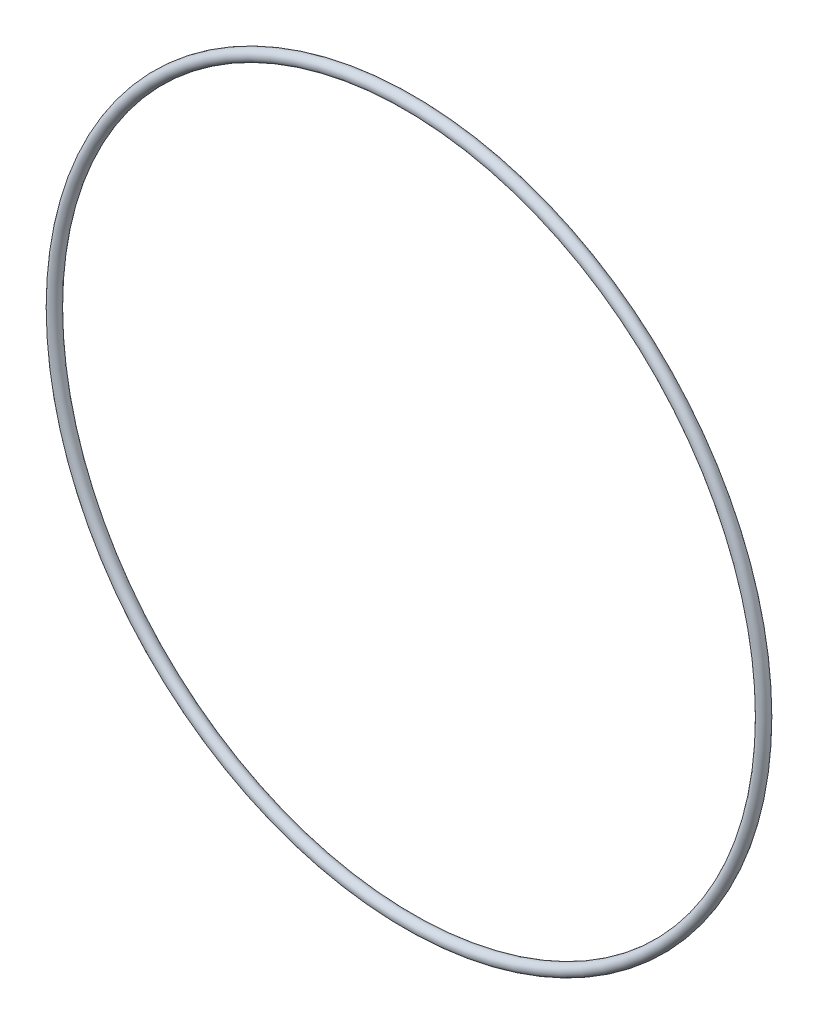
ISO-10303-21;
HEADER;
FILE_DESCRIPTION(('STEP AP214'),'2;1');
FILE_NAME('part.step','',(''),(''),'','','');
FILE_SCHEMA(('AUTOMOTIVE_DESIGN { 1 0 10303 214 1 1 1 1 }'));
ENDSEC;
DATA;
#1=APPLICATION_CONTEXT('core data for automotive mechanical design processes');
#2=APPLICATION_PROTOCOL_DEFINITION('international standard','automotive_design',2000,#1);
#3=PRODUCT_CONTEXT('',#1,'mechanical');
#4=PRODUCT('Part','Part','',(#3));
#5=PRODUCT_RELATED_PRODUCT_CATEGORY('part','',(#4));
#6=PRODUCT_DEFINITION_FORMATION('','',#4);
#7=PRODUCT_DEFINITION_CONTEXT('part definition',#1,'design');
#8=PRODUCT_DEFINITION('design','',#6,#7);
#9=PRODUCT_DEFINITION_SHAPE('','',#8);
#10=(LENGTH_UNIT() NAMED_UNIT(*) SI_UNIT(.MILLI.,.METRE.));
#11=(NAMED_UNIT(*) PLANE_ANGLE_UNIT() SI_UNIT($,.RADIAN.));
#12=(NAMED_UNIT(*) SI_UNIT($,.STERADIAN.) SOLID_ANGLE_UNIT());
#13=UNCERTAINTY_MEASURE_WITH_UNIT(LENGTH_MEASURE(1.E-05),#10,'distance_accuracy_value','');
#14=(GEOMETRIC_REPRESENTATION_CONTEXT(3) GLOBAL_UNCERTAINTY_ASSIGNED_CONTEXT((#13)) GLOBAL_UNIT_ASSIGNED_CONTEXT((#10,
#11,#12)) REPRESENTATION_CONTEXT('',''));
#15=CARTESIAN_POINT('',(0.,0.,0.));
#16=DIRECTION('',(0.,0.,1.));
#17=DIRECTION('',(1.,0.,0.));
#18=AXIS2_PLACEMENT_3D('',#15,#16,#17);
#19=CARTESIAN_POINT('',(0.,0.,0.));
#20=DIRECTION('',(0.,0.,1.));
#21=DIRECTION('',(1.,0.,0.));
#22=AXIS2_PLACEMENT_3D('',#19,#20,#21);
#23=TOROIDAL_SURFACE('',#22,30.5,0.5);
#24=CARTESIAN_POINT('',(30.5,0.,0.));
#25=DIRECTION('',(0.,1.,0.));
#26=DIRECTION('',(-1.,0.,0.));
#27=AXIS2_PLACEMENT_3D('',#24,#25,#26);
#28=CIRCLE('',#27,0.5);
#29=CARTESIAN_POINT('',(31.,0.,0.));
#30=VERTEX_POINT('',#29);
#31=EDGE_CURVE('E11',#30,#30,#28,.T.);
#32=CARTESIAN_POINT('',(0.,0.,0.));
#33=DIRECTION('',(0.,0.,1.));
#34=DIRECTION('',(1.,0.,0.));
#35=AXIS2_PLACEMENT_3D('',#32,#33,#34);
#36=CIRCLE('',#35,31.);
#37=EDGE_CURVE('',#30,#30,#36,.T.);
#38=ORIENTED_EDGE('',*,*,#31,.T.);
#39=ORIENTED_EDGE('',*,*,#31,.F.);
#40=ORIENTED_EDGE('',*,*,#37,.T.);
#41=ORIENTED_EDGE('',*,*,#37,.F.);
#42=EDGE_LOOP('',(#38,#40,#39,#41));
#43=FACE_BOUND('',#42,.T.);
#44=ADVANCED_FACE('F49',(#43),#23,.T.);
#45=CLOSED_SHELL('',(#44));
#46=MANIFOLD_SOLID_BREP('B2',#45);
#47=ADVANCED_BREP_SHAPE_REPRESENTATION('',(#18,#46),#14);
#48=SHAPE_DEFINITION_REPRESENTATION(#9,#47);
ENDSEC;
END-ISO-10303-21;
